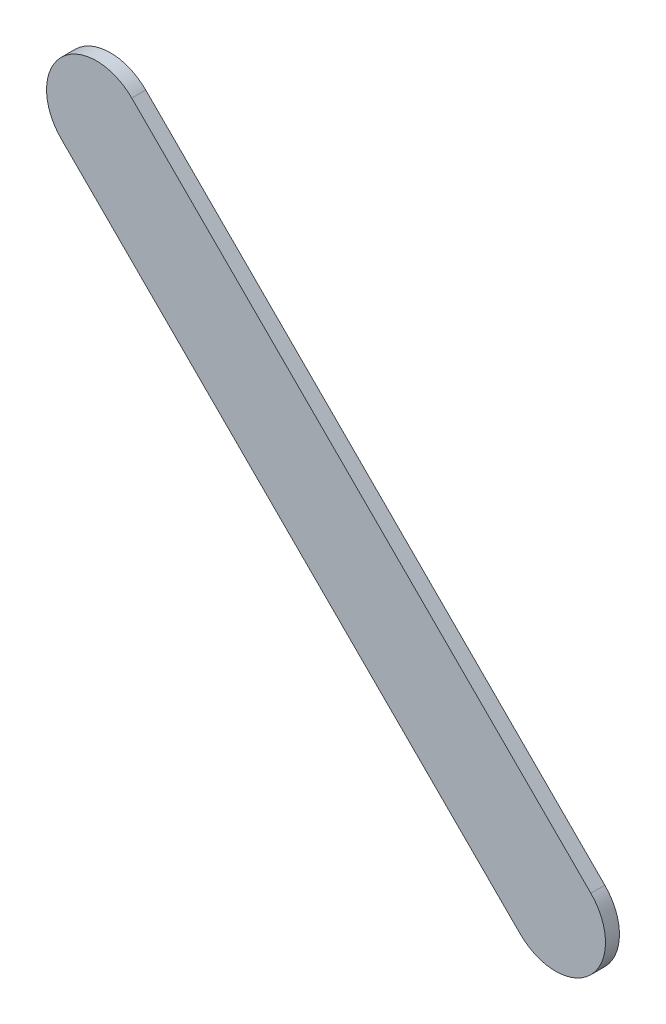
ISO-10303-21;
HEADER;
FILE_DESCRIPTION(('STEP AP214'),'2;1');
FILE_NAME('part.step','',(''),(''),'','','');
FILE_SCHEMA(('AUTOMOTIVE_DESIGN { 1 0 10303 214 1 1 1 1 }'));
ENDSEC;
DATA;
#1=APPLICATION_CONTEXT('core data for automotive mechanical design processes');
#2=APPLICATION_PROTOCOL_DEFINITION('international standard','automotive_design',2000,#1);
#3=PRODUCT_CONTEXT('',#1,'mechanical');
#4=PRODUCT('Part','Part','',(#3));
#5=PRODUCT_RELATED_PRODUCT_CATEGORY('part','',(#4));
#6=PRODUCT_DEFINITION_FORMATION('','',#4);
#7=PRODUCT_DEFINITION_CONTEXT('part definition',#1,'design');
#8=PRODUCT_DEFINITION('design','',#6,#7);
#9=PRODUCT_DEFINITION_SHAPE('','',#8);
#10=(LENGTH_UNIT() NAMED_UNIT(*) SI_UNIT(.MILLI.,.METRE.));
#11=(NAMED_UNIT(*) PLANE_ANGLE_UNIT() SI_UNIT($,.RADIAN.));
#12=(NAMED_UNIT(*) SI_UNIT($,.STERADIAN.) SOLID_ANGLE_UNIT());
#13=UNCERTAINTY_MEASURE_WITH_UNIT(LENGTH_MEASURE(1.E-05),#10,'distance_accuracy_value','');
#14=(GEOMETRIC_REPRESENTATION_CONTEXT(3) GLOBAL_UNCERTAINTY_ASSIGNED_CONTEXT((#13)) GLOBAL_UNIT_ASSIGNED_CONTEXT((#10,
#11,#12)) REPRESENTATION_CONTEXT('',''));
#15=CARTESIAN_POINT('',(0.,0.,0.));
#16=DIRECTION('',(0.,0.,1.));
#17=DIRECTION('',(1.,0.,0.));
#18=AXIS2_PLACEMENT_3D('',#15,#16,#17);
#19=CARTESIAN_POINT('',(86.2612067,89.12989286,0.));
#20=DIRECTION('',(0.707106781186548,0.707106781186548,0.));
#21=DIRECTION('',(0.707106781186548,-0.707106781186548,0.));
#22=AXIS2_PLACEMENT_3D('',#19,#20,#21);
#23=PLANE('',#22);
#24=DIRECTION('',(0.707106781186548,-0.707106781186548,0.));
#25=VECTOR('',#24,1.);
#26=CARTESIAN_POINT('',(86.2612067,89.12989286,0.03556));
#27=LINE('',#26,#25);
#28=CARTESIAN_POINT('',(86.2612067,89.12989286,0.03556));
#29=VERTEX_POINT('',#28);
#30=CARTESIAN_POINT('',(87.42918252,87.96191704,0.03556));
#31=VERTEX_POINT('',#30);
#32=EDGE_CURVE('E11',#29,#31,#27,.T.);
#33=ORIENTED_EDGE('',*,*,#32,.F.);
#34=DIRECTION('',(0.,0.,1.));
#35=VECTOR('',#34,1.);
#36=CARTESIAN_POINT('',(86.2612067,89.12989286,0.));
#37=LINE('',#36,#35);
#38=CARTESIAN_POINT('',(86.2612067,89.12989286,0.));
#39=VERTEX_POINT('',#38);
#40=EDGE_CURVE('E24',#39,#29,#37,.T.);
#41=ORIENTED_EDGE('',*,*,#40,.F.);
#42=DIRECTION('',(0.707106781186548,-0.707106781186548,0.));
#43=VECTOR('',#42,1.);
#44=CARTESIAN_POINT('',(86.2612067,89.12989286,0.));
#45=LINE('',#44,#43);
#46=CARTESIAN_POINT('',(87.42918252,87.96191704,0.));
#47=VERTEX_POINT('',#46);
#48=EDGE_CURVE('E75',#39,#47,#45,.T.);
#49=ORIENTED_EDGE('',*,*,#48,.T.);
#50=DIRECTION('',(0.,0.,1.));
#51=VECTOR('',#50,1.);
#52=CARTESIAN_POINT('',(87.42918252,87.96191704,0.));
#53=LINE('',#52,#51);
#54=EDGE_CURVE('E37',#47,#31,#53,.T.);
#55=ORIENTED_EDGE('',*,*,#54,.T.);
#56=EDGE_LOOP('',(#33,#41,#49,#55));
#57=FACE_BOUND('',#56,.T.);
#58=ADVANCED_FACE('F17',(#57),#23,.F.);
#59=CARTESIAN_POINT('',(87.51898549,88.05172001,0.));
#60=DIRECTION('',(0.,0.,-1.));
#61=DIRECTION('',(-0.707106781186548,-0.707106781186548,0.));
#62=AXIS2_PLACEMENT_3D('',#59,#60,#61);
#63=CYLINDRICAL_SURFACE('',#62,0.127000578115386);
#64=CARTESIAN_POINT('',(87.51898549,88.05172001,0.03556));
#65=DIRECTION('',(0.,0.,1.));
#66=DIRECTION('',(-0.707106781186548,-0.707106781186548,0.));
#67=AXIS2_PLACEMENT_3D('',#64,#65,#66);
#68=CIRCLE('',#67,0.127000578115386);
#69=CARTESIAN_POINT('',(87.60878846,88.14152298,0.03556));
#70=VERTEX_POINT('',#69);
#71=EDGE_CURVE('E83',#31,#70,#68,.T.);
#72=ORIENTED_EDGE('',*,*,#71,.F.);
#73=ORIENTED_EDGE('',*,*,#54,.F.);
#74=CARTESIAN_POINT('',(87.51898549,88.05172001,0.));
#75=DIRECTION('',(0.,0.,1.));
#76=DIRECTION('',(-0.707106781186548,-0.707106781186548,0.));
#77=AXIS2_PLACEMENT_3D('',#74,#75,#76);
#78=CIRCLE('',#77,0.127000578115386);
#79=CARTESIAN_POINT('',(87.60878846,88.14152298,0.));
#80=VERTEX_POINT('',#79);
#81=EDGE_CURVE('E81',#47,#80,#78,.T.);
#82=ORIENTED_EDGE('',*,*,#81,.T.);
#83=DIRECTION('',(0.,0.,1.));
#84=VECTOR('',#83,1.);
#85=CARTESIAN_POINT('',(87.60878846,88.14152298,0.));
#86=LINE('',#85,#84);
#87=EDGE_CURVE('E67',#80,#70,#86,.T.);
#88=ORIENTED_EDGE('',*,*,#87,.T.);
#89=EDGE_LOOP('',(#72,#73,#82,#88));
#90=FACE_BOUND('',#89,.T.);
#91=ADVANCED_FACE('F89',(#90),#63,.T.);
#92=CARTESIAN_POINT('',(87.60878846,88.14152298,0.));
#93=DIRECTION('',(-0.707106781186548,-0.707106781186548,0.));
#94=DIRECTION('',(-0.707106781186548,0.707106781186548,0.));
#95=AXIS2_PLACEMENT_3D('',#92,#93,#94);
#96=PLANE('',#95);
#97=DIRECTION('',(-0.707106781186548,0.707106781186548,0.));
#98=VECTOR('',#97,1.);
#99=CARTESIAN_POINT('',(87.60878846,88.14152298,0.03556));
#100=LINE('',#99,#98);
#101=CARTESIAN_POINT('',(86.44081264,89.3094988,0.03556));
#102=VERTEX_POINT('',#101);
#103=EDGE_CURVE('E71',#70,#102,#100,.T.);
#104=ORIENTED_EDGE('',*,*,#103,.F.);
#105=ORIENTED_EDGE('',*,*,#87,.F.);
#106=DIRECTION('',(-0.707106781186548,0.707106781186548,0.));
#107=VECTOR('',#106,1.);
#108=CARTESIAN_POINT('',(87.60878846,88.14152298,0.));
#109=LINE('',#108,#107);
#110=CARTESIAN_POINT('',(86.44081264,89.3094988,0.));
#111=VERTEX_POINT('',#110);
#112=EDGE_CURVE('E63',#80,#111,#109,.T.);
#113=ORIENTED_EDGE('',*,*,#112,.T.);
#114=DIRECTION('',(0.,0.,1.));
#115=VECTOR('',#114,1.);
#116=CARTESIAN_POINT('',(86.44081264,89.3094988,0.));
#117=LINE('',#116,#115);
#118=EDGE_CURVE('E53',#111,#102,#117,.T.);
#119=ORIENTED_EDGE('',*,*,#118,.T.);
#120=EDGE_LOOP('',(#104,#105,#113,#119));
#121=FACE_BOUND('',#120,.T.);
#122=ADVANCED_FACE('F66',(#121),#96,.F.);
#123=CARTESIAN_POINT('',(86.35100967,89.21969583,0.));
#124=DIRECTION('',(0.,0.,-1.));
#125=DIRECTION('',(0.707106781186548,0.707106781186548,0.));
#126=AXIS2_PLACEMENT_3D('',#123,#124,#125);
#127=CYLINDRICAL_SURFACE('',#126,0.127000578115386);
#128=CARTESIAN_POINT('',(86.35100967,89.21969583,0.03556));
#129=DIRECTION('',(0.,0.,1.));
#130=DIRECTION('',(0.707106781186548,0.707106781186548,0.));
#131=AXIS2_PLACEMENT_3D('',#128,#129,#130);
#132=CIRCLE('',#131,0.127000578115386);
#133=EDGE_CURVE('E59',#102,#29,#132,.T.);
#134=ORIENTED_EDGE('',*,*,#133,.F.);
#135=ORIENTED_EDGE('',*,*,#118,.F.);
#136=CARTESIAN_POINT('',(86.35100967,89.21969583,0.));
#137=DIRECTION('',(0.,0.,1.));
#138=DIRECTION('',(0.707106781186548,0.707106781186548,0.));
#139=AXIS2_PLACEMENT_3D('',#136,#137,#138);
#140=CIRCLE('',#139,0.127000578115386);
#141=EDGE_CURVE('E57',#111,#39,#140,.T.);
#142=ORIENTED_EDGE('',*,*,#141,.T.);
#143=ORIENTED_EDGE('',*,*,#40,.T.);
#144=EDGE_LOOP('',(#134,#135,#142,#143));
#145=FACE_BOUND('',#144,.T.);
#146=ADVANCED_FACE('F55',(#145),#127,.T.);
#147=CARTESIAN_POINT('',(86.2612067,89.12989286,0.));
#148=DIRECTION('',(0.,0.,-1.));
#149=DIRECTION('',(-1.,0.,0.));
#150=AXIS2_PLACEMENT_3D('',#147,#148,#149);
#151=PLANE('',#150);
#152=ORIENTED_EDGE('',*,*,#141,.F.);
#153=ORIENTED_EDGE('',*,*,#112,.F.);
#154=ORIENTED_EDGE('',*,*,#81,.F.);
#155=ORIENTED_EDGE('',*,*,#48,.F.);
#156=EDGE_LOOP('',(#152,#153,#154,#155));
#157=FACE_BOUND('',#156,.T.);
#158=ADVANCED_FACE('F74',(#157),#151,.T.);
#159=CARTESIAN_POINT('',(86.2612067,89.12989286,0.03556));
#160=DIRECTION('',(0.,0.,-1.));
#161=DIRECTION('',(-1.,0.,0.));
#162=AXIS2_PLACEMENT_3D('',#159,#160,#161);
#163=PLANE('',#162);
#164=ORIENTED_EDGE('',*,*,#32,.T.);
#165=ORIENTED_EDGE('',*,*,#71,.T.);
#166=ORIENTED_EDGE('',*,*,#103,.T.);
#167=ORIENTED_EDGE('',*,*,#133,.T.);
#168=EDGE_LOOP('',(#164,#165,#166,#167));
#169=FACE_BOUND('',#168,.T.);
#170=ADVANCED_FACE('F91',(#169),#163,.F.);
#171=CLOSED_SHELL('',(#58,#91,#122,#146,#158,#170));
#172=MANIFOLD_SOLID_BREP('B1',#171);
#173=ADVANCED_BREP_SHAPE_REPRESENTATION('',(#18,#172),#14);
#174=SHAPE_DEFINITION_REPRESENTATION(#9,#173);
ENDSEC;
END-ISO-10303-21;
